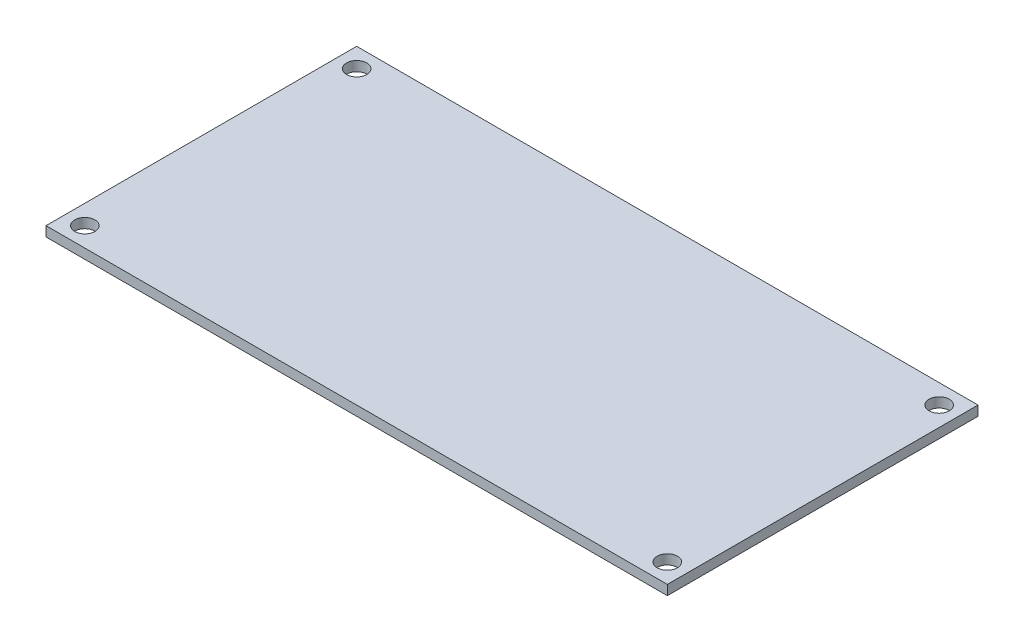
ISO-10303-21;
HEADER;
FILE_DESCRIPTION(('STEP AP214'),'2;1');
FILE_NAME('part.step','',(''),(''),'','','');
FILE_SCHEMA(('AUTOMOTIVE_DESIGN { 1 0 10303 214 1 1 1 1 }'));
ENDSEC;
DATA;
#1=APPLICATION_CONTEXT('core data for automotive mechanical design processes');
#2=APPLICATION_PROTOCOL_DEFINITION('international standard','automotive_design',2000,#1);
#3=PRODUCT_CONTEXT('',#1,'mechanical');
#4=PRODUCT('Part','Part','',(#3));
#5=PRODUCT_RELATED_PRODUCT_CATEGORY('part','',(#4));
#6=PRODUCT_DEFINITION_FORMATION('','',#4);
#7=PRODUCT_DEFINITION_CONTEXT('part definition',#1,'design');
#8=PRODUCT_DEFINITION('design','',#6,#7);
#9=PRODUCT_DEFINITION_SHAPE('','',#8);
#10=(LENGTH_UNIT() NAMED_UNIT(*) SI_UNIT(.MILLI.,.METRE.));
#11=(NAMED_UNIT(*) PLANE_ANGLE_UNIT() SI_UNIT($,.RADIAN.));
#12=(NAMED_UNIT(*) SI_UNIT($,.STERADIAN.) SOLID_ANGLE_UNIT());
#13=UNCERTAINTY_MEASURE_WITH_UNIT(LENGTH_MEASURE(1.E-05),#10,'distance_accuracy_value','');
#14=(GEOMETRIC_REPRESENTATION_CONTEXT(3) GLOBAL_UNCERTAINTY_ASSIGNED_CONTEXT((#13)) GLOBAL_UNIT_ASSIGNED_CONTEXT((#10,
#11,#12)) REPRESENTATION_CONTEXT('',''));
#15=CARTESIAN_POINT('',(0.,0.,0.));
#16=DIRECTION('',(0.,0.,1.));
#17=DIRECTION('',(1.,0.,0.));
#18=AXIS2_PLACEMENT_3D('',#15,#16,#17);
#19=CARTESIAN_POINT('',(50.8,1.6,25.4));
#20=DIRECTION('',(-1.,0.,0.));
#21=DIRECTION('',(0.,0.,1.));
#22=AXIS2_PLACEMENT_3D('',#19,#20,#21);
#23=PLANE('',#22);
#24=DIRECTION('',(0.,0.,-1.));
#25=VECTOR('',#24,1.);
#26=CARTESIAN_POINT('',(50.8,0.,25.4));
#27=LINE('',#26,#25);
#28=CARTESIAN_POINT('',(50.8,0.,25.4));
#29=VERTEX_POINT('',#28);
#30=CARTESIAN_POINT('',(50.8,0.,-25.4));
#31=VERTEX_POINT('',#30);
#32=EDGE_CURVE('E100',#29,#31,#27,.T.);
#33=ORIENTED_EDGE('',*,*,#32,.T.);
#34=DIRECTION('',(0.,-1.,0.));
#35=VECTOR('',#34,1.);
#36=CARTESIAN_POINT('',(50.8,1.6,-25.4));
#37=LINE('',#36,#35);
#38=CARTESIAN_POINT('',(50.8,1.6,-25.4));
#39=VERTEX_POINT('',#38);
#40=EDGE_CURVE('E11',#39,#31,#37,.T.);
#41=ORIENTED_EDGE('',*,*,#40,.F.);
#42=DIRECTION('',(0.,0.,-1.));
#43=VECTOR('',#42,1.);
#44=CARTESIAN_POINT('',(50.8,1.6,25.4));
#45=LINE('',#44,#43);
#46=CARTESIAN_POINT('',(50.8,1.6,25.4));
#47=VERTEX_POINT('',#46);
#48=EDGE_CURVE('E88',#47,#39,#45,.T.);
#49=ORIENTED_EDGE('',*,*,#48,.F.);
#50=DIRECTION('',(0.,-1.,0.));
#51=VECTOR('',#50,1.);
#52=CARTESIAN_POINT('',(50.8,1.6,25.4));
#53=LINE('',#52,#51);
#54=EDGE_CURVE('E96',#47,#29,#53,.T.);
#55=ORIENTED_EDGE('',*,*,#54,.T.);
#56=EDGE_LOOP('',(#33,#41,#49,#55));
#57=FACE_BOUND('',#56,.T.);
#58=ADVANCED_FACE('F37',(#57),#23,.F.);
#59=CARTESIAN_POINT('',(-50.8,1.6,-25.4));
#60=DIRECTION('',(0.,0.,1.));
#61=DIRECTION('',(1.,0.,0.));
#62=AXIS2_PLACEMENT_3D('',#59,#60,#61);
#63=PLANE('',#62);
#64=DIRECTION('',(-1.,0.,0.));
#65=VECTOR('',#64,1.);
#66=CARTESIAN_POINT('',(-50.8,0.,-25.4));
#67=LINE('',#66,#65);
#68=CARTESIAN_POINT('',(-50.8,0.,-25.4));
#69=VERTEX_POINT('',#68);
#70=EDGE_CURVE('E92',#31,#69,#67,.T.);
#71=ORIENTED_EDGE('',*,*,#70,.T.);
#72=DIRECTION('',(0.,-1.,0.));
#73=VECTOR('',#72,1.);
#74=CARTESIAN_POINT('',(-50.8,1.6,-25.4));
#75=LINE('',#74,#73);
#76=CARTESIAN_POINT('',(-50.8,1.6,-25.4));
#77=VERTEX_POINT('',#76);
#78=EDGE_CURVE('E45',#77,#69,#75,.T.);
#79=ORIENTED_EDGE('',*,*,#78,.F.);
#80=DIRECTION('',(-1.,0.,0.));
#81=VECTOR('',#80,1.);
#82=CARTESIAN_POINT('',(-50.8,1.6,-25.4));
#83=LINE('',#82,#81);
#84=EDGE_CURVE('E83',#39,#77,#83,.T.);
#85=ORIENTED_EDGE('',*,*,#84,.F.);
#86=ORIENTED_EDGE('',*,*,#40,.T.);
#87=EDGE_LOOP('',(#71,#79,#85,#86));
#88=FACE_BOUND('',#87,.T.);
#89=ADVANCED_FACE('F91',(#88),#63,.F.);
#90=CARTESIAN_POINT('',(-50.8,1.6,25.4));
#91=DIRECTION('',(1.,0.,0.));
#92=DIRECTION('',(0.,0.,-1.));
#93=AXIS2_PLACEMENT_3D('',#90,#91,#92);
#94=PLANE('',#93);
#95=DIRECTION('',(0.,0.,1.));
#96=VECTOR('',#95,1.);
#97=CARTESIAN_POINT('',(-50.8,0.,25.4));
#98=LINE('',#97,#96);
#99=CARTESIAN_POINT('',(-50.8,0.,25.4));
#100=VERTEX_POINT('',#99);
#101=EDGE_CURVE('E70',#69,#100,#98,.T.);
#102=ORIENTED_EDGE('',*,*,#101,.T.);
#103=DIRECTION('',(0.,-1.,0.));
#104=VECTOR('',#103,1.);
#105=CARTESIAN_POINT('',(-50.8,1.6,25.4));
#106=LINE('',#105,#104);
#107=CARTESIAN_POINT('',(-50.8,1.6,25.4));
#108=VERTEX_POINT('',#107);
#109=EDGE_CURVE('E93',#108,#100,#106,.T.);
#110=ORIENTED_EDGE('',*,*,#109,.F.);
#111=DIRECTION('',(0.,0.,1.));
#112=VECTOR('',#111,1.);
#113=CARTESIAN_POINT('',(-50.8,1.6,25.4));
#114=LINE('',#113,#112);
#115=EDGE_CURVE('E86',#77,#108,#114,.T.);
#116=ORIENTED_EDGE('',*,*,#115,.F.);
#117=ORIENTED_EDGE('',*,*,#78,.T.);
#118=EDGE_LOOP('',(#102,#110,#116,#117));
#119=FACE_BOUND('',#118,.T.);
#120=ADVANCED_FACE('F94',(#119),#94,.F.);
#121=CARTESIAN_POINT('',(-50.8,1.6,25.4));
#122=DIRECTION('',(0.,0.,-1.));
#123=DIRECTION('',(-1.,0.,0.));
#124=AXIS2_PLACEMENT_3D('',#121,#122,#123);
#125=PLANE('',#124);
#126=DIRECTION('',(1.,0.,0.));
#127=VECTOR('',#126,1.);
#128=CARTESIAN_POINT('',(-50.8,0.,25.4));
#129=LINE('',#128,#127);
#130=EDGE_CURVE('E76',#100,#29,#129,.T.);
#131=ORIENTED_EDGE('',*,*,#130,.T.);
#132=ORIENTED_EDGE('',*,*,#54,.F.);
#133=DIRECTION('',(1.,0.,0.));
#134=VECTOR('',#133,1.);
#135=CARTESIAN_POINT('',(-50.8,1.6,25.4));
#136=LINE('',#135,#134);
#137=EDGE_CURVE('E53',#108,#47,#136,.T.);
#138=ORIENTED_EDGE('',*,*,#137,.F.);
#139=ORIENTED_EDGE('',*,*,#109,.T.);
#140=EDGE_LOOP('',(#131,#132,#138,#139));
#141=FACE_BOUND('',#140,.T.);
#142=ADVANCED_FACE('F108',(#141),#125,.F.);
#143=CARTESIAN_POINT('',(0.,1.6,0.));
#144=DIRECTION('',(0.,-1.,0.));
#145=DIRECTION('',(0.,0.,-1.));
#146=AXIS2_PLACEMENT_3D('',#143,#144,#145);
#147=PLANE('',#146);
#148=CARTESIAN_POINT('',(-47.625,1.6,-22.225));
#149=DIRECTION('',(0.,1.,0.));
#150=DIRECTION('',(0.,0.,1.));
#151=AXIS2_PLACEMENT_3D('',#148,#149,#150);
#152=CIRCLE('',#151,1.65);
#153=CARTESIAN_POINT('',(-47.625,1.6,-20.575));
#154=VERTEX_POINT('',#153);
#155=EDGE_CURVE('E134',#154,#154,#152,.T.);
#156=ORIENTED_EDGE('',*,*,#155,.F.);
#157=EDGE_LOOP('',(#156));
#158=FACE_BOUND('',#157,.T.);
#159=CARTESIAN_POINT('',(47.625,1.6,-22.225));
#160=DIRECTION('',(0.,1.,0.));
#161=DIRECTION('',(0.,0.,1.));
#162=AXIS2_PLACEMENT_3D('',#159,#160,#161);
#163=CIRCLE('',#162,1.65);
#164=CARTESIAN_POINT('',(47.625,1.6,-20.575));
#165=VERTEX_POINT('',#164);
#166=EDGE_CURVE('E128',#165,#165,#163,.T.);
#167=ORIENTED_EDGE('',*,*,#166,.F.);
#168=EDGE_LOOP('',(#167));
#169=FACE_BOUND('',#168,.T.);
#170=CARTESIAN_POINT('',(47.625,1.6,22.225));
#171=DIRECTION('',(0.,1.,0.));
#172=DIRECTION('',(0.,0.,1.));
#173=AXIS2_PLACEMENT_3D('',#170,#171,#172);
#174=CIRCLE('',#173,1.65);
#175=CARTESIAN_POINT('',(47.625,1.6,23.875));
#176=VERTEX_POINT('',#175);
#177=EDGE_CURVE('E122',#176,#176,#174,.T.);
#178=ORIENTED_EDGE('',*,*,#177,.F.);
#179=EDGE_LOOP('',(#178));
#180=FACE_BOUND('',#179,.T.);
#181=CARTESIAN_POINT('',(-47.625,1.6,22.225));
#182=DIRECTION('',(0.,1.,0.));
#183=DIRECTION('',(0.,0.,1.));
#184=AXIS2_PLACEMENT_3D('',#181,#182,#183);
#185=CIRCLE('',#184,1.65);
#186=CARTESIAN_POINT('',(-47.625,1.6,23.875));
#187=VERTEX_POINT('',#186);
#188=EDGE_CURVE('E116',#187,#187,#185,.T.);
#189=ORIENTED_EDGE('',*,*,#188,.F.);
#190=EDGE_LOOP('',(#189));
#191=FACE_BOUND('',#190,.T.);
#192=ORIENTED_EDGE('',*,*,#48,.T.);
#193=ORIENTED_EDGE('',*,*,#84,.T.);
#194=ORIENTED_EDGE('',*,*,#115,.T.);
#195=ORIENTED_EDGE('',*,*,#137,.T.);
#196=EDGE_LOOP('',(#192,#193,#194,#195));
#197=FACE_BOUND('',#196,.T.);
#198=ADVANCED_FACE('F84',(#158,#169,#180,#191,#197),#147,.F.);
#199=CARTESIAN_POINT('',(0.,0.,0.));
#200=DIRECTION('',(0.,-1.,0.));
#201=DIRECTION('',(0.,0.,-1.));
#202=AXIS2_PLACEMENT_3D('',#199,#200,#201);
#203=PLANE('',#202);
#204=CARTESIAN_POINT('',(-47.625,0.,-22.225));
#205=DIRECTION('',(0.,1.,0.));
#206=DIRECTION('',(0.,0.,1.));
#207=AXIS2_PLACEMENT_3D('',#204,#205,#206);
#208=CIRCLE('',#207,1.65);
#209=CARTESIAN_POINT('',(-47.625,0.,-20.575));
#210=VERTEX_POINT('',#209);
#211=EDGE_CURVE('E131',#210,#210,#208,.T.);
#212=ORIENTED_EDGE('',*,*,#211,.T.);
#213=EDGE_LOOP('',(#212));
#214=FACE_BOUND('',#213,.T.);
#215=CARTESIAN_POINT('',(47.625,0.,-22.225));
#216=DIRECTION('',(0.,1.,0.));
#217=DIRECTION('',(0.,0.,1.));
#218=AXIS2_PLACEMENT_3D('',#215,#216,#217);
#219=CIRCLE('',#218,1.65);
#220=CARTESIAN_POINT('',(47.625,0.,-20.575));
#221=VERTEX_POINT('',#220);
#222=EDGE_CURVE('E125',#221,#221,#219,.T.);
#223=ORIENTED_EDGE('',*,*,#222,.T.);
#224=EDGE_LOOP('',(#223));
#225=FACE_BOUND('',#224,.T.);
#226=CARTESIAN_POINT('',(47.625,0.,22.225));
#227=DIRECTION('',(0.,1.,0.));
#228=DIRECTION('',(0.,0.,1.));
#229=AXIS2_PLACEMENT_3D('',#226,#227,#228);
#230=CIRCLE('',#229,1.65);
#231=CARTESIAN_POINT('',(47.625,0.,23.875));
#232=VERTEX_POINT('',#231);
#233=EDGE_CURVE('E119',#232,#232,#230,.T.);
#234=ORIENTED_EDGE('',*,*,#233,.T.);
#235=EDGE_LOOP('',(#234));
#236=FACE_BOUND('',#235,.T.);
#237=CARTESIAN_POINT('',(-47.625,0.,22.225));
#238=DIRECTION('',(0.,1.,0.));
#239=DIRECTION('',(0.,0.,1.));
#240=AXIS2_PLACEMENT_3D('',#237,#238,#239);
#241=CIRCLE('',#240,1.65);
#242=CARTESIAN_POINT('',(-47.625,0.,23.875));
#243=VERTEX_POINT('',#242);
#244=EDGE_CURVE('E103',#243,#243,#241,.T.);
#245=ORIENTED_EDGE('',*,*,#244,.T.);
#246=EDGE_LOOP('',(#245));
#247=FACE_BOUND('',#246,.T.);
#248=ORIENTED_EDGE('',*,*,#32,.F.);
#249=ORIENTED_EDGE('',*,*,#130,.F.);
#250=ORIENTED_EDGE('',*,*,#101,.F.);
#251=ORIENTED_EDGE('',*,*,#70,.F.);
#252=EDGE_LOOP('',(#248,#249,#250,#251));
#253=FACE_BOUND('',#252,.T.);
#254=ADVANCED_FACE('F111',(#214,#225,#236,#247,#253),#203,.T.);
#255=CARTESIAN_POINT('',(-47.625,1.6,22.225));
#256=DIRECTION('',(0.,1.,0.));
#257=DIRECTION('',(0.,0.,1.));
#258=AXIS2_PLACEMENT_3D('',#255,#256,#257);
#259=CYLINDRICAL_SURFACE('',#258,1.65);
#260=ORIENTED_EDGE('',*,*,#244,.F.);
#261=EDGE_LOOP('',(#260));
#262=FACE_BOUND('',#261,.T.);
#263=ORIENTED_EDGE('',*,*,#188,.T.);
#264=EDGE_LOOP('',(#263));
#265=FACE_BOUND('',#264,.T.);
#266=ADVANCED_FACE('F149',(#262,#265),#259,.F.);
#267=CARTESIAN_POINT('',(47.625,1.6,22.225));
#268=DIRECTION('',(0.,1.,0.));
#269=DIRECTION('',(0.,0.,1.));
#270=AXIS2_PLACEMENT_3D('',#267,#268,#269);
#271=CYLINDRICAL_SURFACE('',#270,1.65);
#272=ORIENTED_EDGE('',*,*,#233,.F.);
#273=EDGE_LOOP('',(#272));
#274=FACE_BOUND('',#273,.T.);
#275=ORIENTED_EDGE('',*,*,#177,.T.);
#276=EDGE_LOOP('',(#275));
#277=FACE_BOUND('',#276,.T.);
#278=ADVANCED_FACE('F151',(#274,#277),#271,.F.);
#279=CARTESIAN_POINT('',(47.625,1.6,-22.225));
#280=DIRECTION('',(0.,1.,0.));
#281=DIRECTION('',(0.,0.,1.));
#282=AXIS2_PLACEMENT_3D('',#279,#280,#281);
#283=CYLINDRICAL_SURFACE('',#282,1.65);
#284=ORIENTED_EDGE('',*,*,#222,.F.);
#285=EDGE_LOOP('',(#284));
#286=FACE_BOUND('',#285,.T.);
#287=ORIENTED_EDGE('',*,*,#166,.T.);
#288=EDGE_LOOP('',(#287));
#289=FACE_BOUND('',#288,.T.);
#290=ADVANCED_FACE('F158',(#286,#289),#283,.F.);
#291=CARTESIAN_POINT('',(-47.625,1.6,-22.225));
#292=DIRECTION('',(0.,1.,0.));
#293=DIRECTION('',(0.,0.,1.));
#294=AXIS2_PLACEMENT_3D('',#291,#292,#293);
#295=CYLINDRICAL_SURFACE('',#294,1.65);
#296=ORIENTED_EDGE('',*,*,#211,.F.);
#297=EDGE_LOOP('',(#296));
#298=FACE_BOUND('',#297,.T.);
#299=ORIENTED_EDGE('',*,*,#155,.T.);
#300=EDGE_LOOP('',(#299));
#301=FACE_BOUND('',#300,.T.);
#302=ADVANCED_FACE('F138',(#298,#301),#295,.F.);
#303=CLOSED_SHELL('',(#58,#89,#120,#142,#198,#254,#266,#278,#290,#302));
#304=MANIFOLD_SOLID_BREP('B2',#303);
#305=ADVANCED_BREP_SHAPE_REPRESENTATION('',(#18,#304),#14);
#306=SHAPE_DEFINITION_REPRESENTATION(#9,#305);
ENDSEC;
END-ISO-10303-21;
